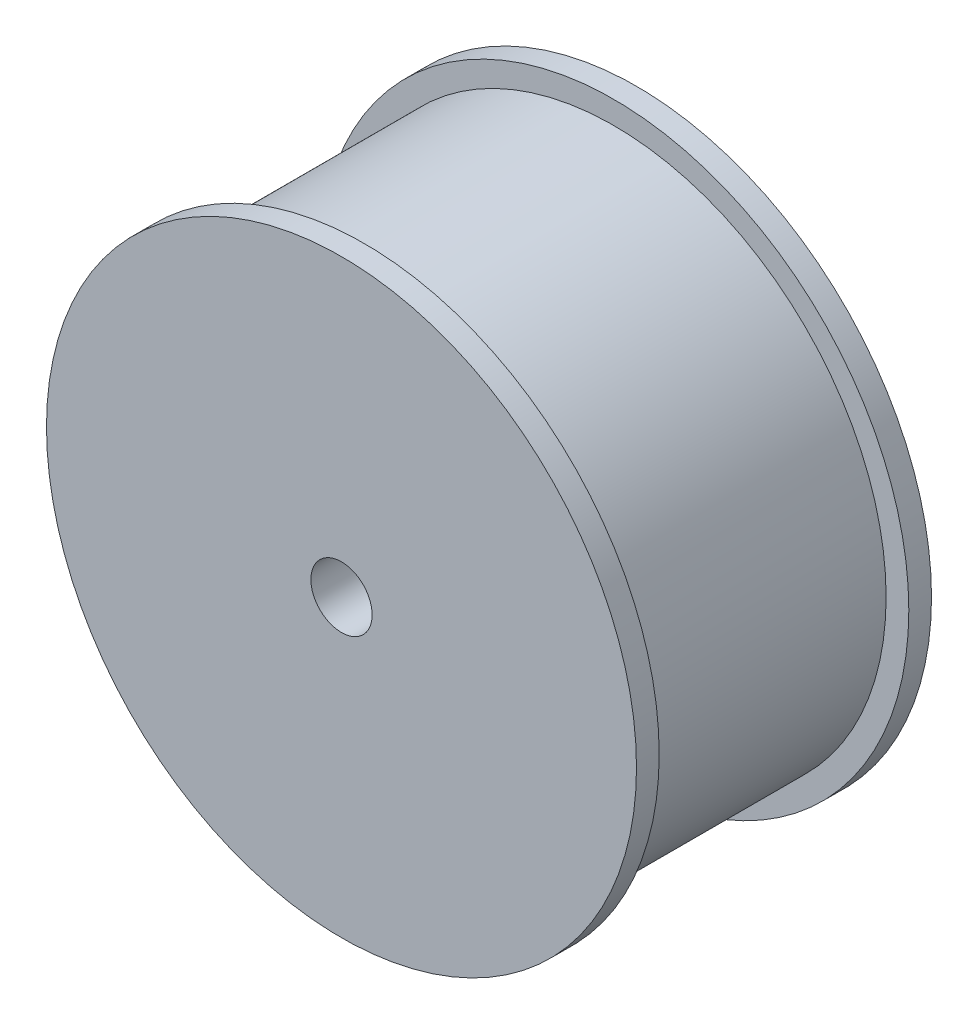
ISO-10303-21;
HEADER;
FILE_DESCRIPTION(('STEP AP214'),'2;1');
FILE_NAME('part.step','',(''),(''),'','','');
FILE_SCHEMA(('AUTOMOTIVE_DESIGN { 1 0 10303 214 1 1 1 1 }'));
ENDSEC;
DATA;
#1=APPLICATION_CONTEXT('core data for automotive mechanical design processes');
#2=APPLICATION_PROTOCOL_DEFINITION('international standard','automotive_design',2000,#1);
#3=PRODUCT_CONTEXT('',#1,'mechanical');
#4=PRODUCT('Part','Part','',(#3));
#5=PRODUCT_RELATED_PRODUCT_CATEGORY('part','',(#4));
#6=PRODUCT_DEFINITION_FORMATION('','',#4);
#7=PRODUCT_DEFINITION_CONTEXT('part definition',#1,'design');
#8=PRODUCT_DEFINITION('design','',#6,#7);
#9=PRODUCT_DEFINITION_SHAPE('','',#8);
#10=(LENGTH_UNIT() NAMED_UNIT(*) SI_UNIT(.MILLI.,.METRE.));
#11=(NAMED_UNIT(*) PLANE_ANGLE_UNIT() SI_UNIT($,.RADIAN.));
#12=(NAMED_UNIT(*) SI_UNIT($,.STERADIAN.) SOLID_ANGLE_UNIT());
#13=UNCERTAINTY_MEASURE_WITH_UNIT(LENGTH_MEASURE(1.E-05),#10,'distance_accuracy_value','');
#14=(GEOMETRIC_REPRESENTATION_CONTEXT(3) GLOBAL_UNCERTAINTY_ASSIGNED_CONTEXT((#13)) GLOBAL_UNIT_ASSIGNED_CONTEXT((#10,
#11,#12)) REPRESENTATION_CONTEXT('',''));
#15=CARTESIAN_POINT('',(0.,0.,0.));
#16=DIRECTION('',(0.,0.,1.));
#17=DIRECTION('',(1.,0.,0.));
#18=AXIS2_PLACEMENT_3D('',#15,#16,#17);
#19=CARTESIAN_POINT('',(0.,0.,-13.));
#20=DIRECTION('',(0.,0.,-1.));
#21=DIRECTION('',(1.,0.,0.));
#22=AXIS2_PLACEMENT_3D('',#19,#20,#21);
#23=PLANE('',#22);
#24=CARTESIAN_POINT('',(0.,0.,-13.));
#25=DIRECTION('',(0.,0.,1.));
#26=DIRECTION('',(1.,0.,0.));
#27=AXIS2_PLACEMENT_3D('',#24,#25,#26);
#28=CIRCLE('',#27,26.);
#29=CARTESIAN_POINT('',(26.,0.,-13.));
#30=VERTEX_POINT('',#29);
#31=EDGE_CURVE('E69',#30,#30,#28,.T.);
#32=ORIENTED_EDGE('',*,*,#31,.F.);
#33=EDGE_LOOP('',(#32));
#34=FACE_BOUND('',#33,.T.);
#35=CARTESIAN_POINT('',(0.,0.,-13.));
#36=DIRECTION('',(0.,0.,-1.));
#37=DIRECTION('',(-1.,0.,0.));
#38=AXIS2_PLACEMENT_3D('',#35,#36,#37);
#39=CIRCLE('',#38,6.5);
#40=CARTESIAN_POINT('',(-6.5,0.,-13.));
#41=VERTEX_POINT('',#40);
#42=EDGE_CURVE('E78',#41,#41,#39,.T.);
#43=ORIENTED_EDGE('',*,*,#42,.F.);
#44=EDGE_LOOP('',(#43));
#45=FACE_BOUND('',#44,.T.);
#46=ADVANCED_FACE('F45',(#34,#45),#23,.T.);
#47=CARTESIAN_POINT('',(0.,0.,11.));
#48=DIRECTION('',(0.,0.,-1.));
#49=DIRECTION('',(-1.,0.,0.));
#50=AXIS2_PLACEMENT_3D('',#47,#48,#49);
#51=CYLINDRICAL_SURFACE('',#50,24.);
#52=CARTESIAN_POINT('',(0.,0.,11.));
#53=DIRECTION('',(0.,0.,1.));
#54=DIRECTION('',(1.,0.,0.));
#55=AXIS2_PLACEMENT_3D('',#52,#53,#54);
#56=CIRCLE('',#55,24.);
#57=CARTESIAN_POINT('',(24.,0.,11.));
#58=VERTEX_POINT('',#57);
#59=EDGE_CURVE('E10',#58,#58,#56,.T.);
#60=ORIENTED_EDGE('',*,*,#59,.F.);
#61=EDGE_LOOP('',(#60));
#62=FACE_BOUND('',#61,.T.);
#63=CARTESIAN_POINT('',(0.,0.,-11.));
#64=DIRECTION('',(0.,0.,1.));
#65=DIRECTION('',(1.,0.,0.));
#66=AXIS2_PLACEMENT_3D('',#63,#64,#65);
#67=CIRCLE('',#66,24.);
#68=CARTESIAN_POINT('',(24.,0.,-11.));
#69=VERTEX_POINT('',#68);
#70=EDGE_CURVE('E49',#69,#69,#67,.T.);
#71=ORIENTED_EDGE('',*,*,#70,.T.);
#72=EDGE_LOOP('',(#71));
#73=FACE_BOUND('',#72,.T.);
#74=ADVANCED_FACE('F47',(#62,#73),#51,.T.);
#75=CARTESIAN_POINT('',(0.,0.,13.));
#76=DIRECTION('',(0.,0.,-1.));
#77=DIRECTION('',(-1.,0.,0.));
#78=AXIS2_PLACEMENT_3D('',#75,#76,#77);
#79=CYLINDRICAL_SURFACE('',#78,26.);
#80=CARTESIAN_POINT('',(0.,0.,13.));
#81=DIRECTION('',(0.,0.,1.));
#82=DIRECTION('',(1.,0.,0.));
#83=AXIS2_PLACEMENT_3D('',#80,#81,#82);
#84=CIRCLE('',#83,26.);
#85=CARTESIAN_POINT('',(26.,0.,13.));
#86=VERTEX_POINT('',#85);
#87=EDGE_CURVE('E54',#86,#86,#84,.T.);
#88=ORIENTED_EDGE('',*,*,#87,.F.);
#89=EDGE_LOOP('',(#88));
#90=FACE_BOUND('',#89,.T.);
#91=CARTESIAN_POINT('',(0.,0.,11.));
#92=DIRECTION('',(0.,0.,1.));
#93=DIRECTION('',(1.,0.,0.));
#94=AXIS2_PLACEMENT_3D('',#91,#92,#93);
#95=CIRCLE('',#94,26.);
#96=CARTESIAN_POINT('',(26.,0.,11.));
#97=VERTEX_POINT('',#96);
#98=EDGE_CURVE('E59',#97,#97,#95,.T.);
#99=ORIENTED_EDGE('',*,*,#98,.T.);
#100=EDGE_LOOP('',(#99));
#101=FACE_BOUND('',#100,.T.);
#102=ADVANCED_FACE('F112',(#90,#101),#79,.T.);
#103=CARTESIAN_POINT('',(0.,0.,13.));
#104=DIRECTION('',(0.,0.,1.));
#105=DIRECTION('',(1.,0.,0.));
#106=AXIS2_PLACEMENT_3D('',#103,#104,#105);
#107=PLANE('',#106);
#108=CARTESIAN_POINT('',(0.,0.,13.));
#109=DIRECTION('',(0.,0.,1.));
#110=DIRECTION('',(1.,0.,0.));
#111=AXIS2_PLACEMENT_3D('',#108,#109,#110);
#112=CIRCLE('',#111,2.7);
#113=CARTESIAN_POINT('',(2.7,0.,13.));
#114=VERTEX_POINT('',#113);
#115=EDGE_CURVE('E70',#114,#114,#112,.T.);
#116=ORIENTED_EDGE('',*,*,#115,.F.);
#117=EDGE_LOOP('',(#116));
#118=FACE_BOUND('',#117,.T.);
#119=ORIENTED_EDGE('',*,*,#87,.T.);
#120=EDGE_LOOP('',(#119));
#121=FACE_BOUND('',#120,.T.);
#122=ADVANCED_FACE('F125',(#118,#121),#107,.T.);
#123=CARTESIAN_POINT('',(0.,0.,11.));
#124=DIRECTION('',(0.,0.,1.));
#125=DIRECTION('',(1.,0.,0.));
#126=AXIS2_PLACEMENT_3D('',#123,#124,#125);
#127=PLANE('',#126);
#128=ORIENTED_EDGE('',*,*,#59,.T.);
#129=EDGE_LOOP('',(#128));
#130=FACE_BOUND('',#129,.T.);
#131=ORIENTED_EDGE('',*,*,#98,.F.);
#132=EDGE_LOOP('',(#131));
#133=FACE_BOUND('',#132,.T.);
#134=ADVANCED_FACE('F123',(#130,#133),#127,.F.);
#135=CARTESIAN_POINT('',(0.,0.,-13.));
#136=DIRECTION('',(0.,0.,1.));
#137=DIRECTION('',(1.,0.,0.));
#138=AXIS2_PLACEMENT_3D('',#135,#136,#137);
#139=CYLINDRICAL_SURFACE('',#138,26.);
#140=ORIENTED_EDGE('',*,*,#31,.T.);
#141=EDGE_LOOP('',(#140));
#142=FACE_BOUND('',#141,.T.);
#143=CARTESIAN_POINT('',(0.,0.,-11.));
#144=DIRECTION('',(0.,0.,1.));
#145=DIRECTION('',(1.,0.,0.));
#146=AXIS2_PLACEMENT_3D('',#143,#144,#145);
#147=CIRCLE('',#146,26.);
#148=CARTESIAN_POINT('',(26.,0.,-11.));
#149=VERTEX_POINT('',#148);
#150=EDGE_CURVE('E65',#149,#149,#147,.T.);
#151=ORIENTED_EDGE('',*,*,#150,.F.);
#152=EDGE_LOOP('',(#151));
#153=FACE_BOUND('',#152,.T.);
#154=ADVANCED_FACE('F119',(#142,#153),#139,.T.);
#155=CARTESIAN_POINT('',(0.,0.,-11.));
#156=DIRECTION('',(0.,0.,-1.));
#157=DIRECTION('',(1.,0.,0.));
#158=AXIS2_PLACEMENT_3D('',#155,#156,#157);
#159=PLANE('',#158);
#160=ORIENTED_EDGE('',*,*,#70,.F.);
#161=EDGE_LOOP('',(#160));
#162=FACE_BOUND('',#161,.T.);
#163=ORIENTED_EDGE('',*,*,#150,.T.);
#164=EDGE_LOOP('',(#163));
#165=FACE_BOUND('',#164,.T.);
#166=ADVANCED_FACE('F103',(#162,#165),#159,.F.);
#167=CARTESIAN_POINT('',(0.,0.,-13.));
#168=DIRECTION('',(0.,0.,1.));
#169=DIRECTION('',(1.,0.,0.));
#170=AXIS2_PLACEMENT_3D('',#167,#168,#169);
#171=CYLINDRICAL_SURFACE('',#170,2.7);
#172=CARTESIAN_POINT('',(0.,0.,-17.));
#173=DIRECTION('',(0.,0.,-1.));
#174=DIRECTION('',(-1.,0.,0.));
#175=AXIS2_PLACEMENT_3D('',#172,#173,#174);
#176=CIRCLE('',#175,2.7);
#177=CARTESIAN_POINT('',(2.7,0.,-17.));
#178=VERTEX_POINT('',#177);
#179=EDGE_CURVE('E82',#178,#178,#176,.T.);
#180=CARTESIAN_POINT('',(2.7,0.,13.));
#181=CARTESIAN_POINT('',(2.7,0.,12.6875));
#182=CARTESIAN_POINT('',(2.7,0.,12.375));
#183=CARTESIAN_POINT('',(2.7,0.,11.75));
#184=CARTESIAN_POINT('',(2.7,0.,11.4375));
#185=CARTESIAN_POINT('',(2.7,0.,10.8125));
#186=CARTESIAN_POINT('',(2.7,0.,10.5));
#187=CARTESIAN_POINT('',(2.7,0.,9.875));
#188=CARTESIAN_POINT('',(2.7,0.,9.5625));
#189=CARTESIAN_POINT('',(2.7,0.,8.9375));
#190=CARTESIAN_POINT('',(2.7,0.,8.625));
#191=CARTESIAN_POINT('',(2.7,0.,8.));
#192=CARTESIAN_POINT('',(2.7,0.,7.6875));
#193=CARTESIAN_POINT('',(2.7,0.,7.0625));
#194=CARTESIAN_POINT('',(2.7,0.,6.75));
#195=CARTESIAN_POINT('',(2.7,0.,6.125));
#196=CARTESIAN_POINT('',(2.7,0.,5.8125));
#197=CARTESIAN_POINT('',(2.7,0.,5.1875));
#198=CARTESIAN_POINT('',(2.7,0.,4.875));
#199=CARTESIAN_POINT('',(2.7,0.,4.25));
#200=CARTESIAN_POINT('',(2.7,0.,3.9375));
#201=CARTESIAN_POINT('',(2.7,0.,3.3125));
#202=CARTESIAN_POINT('',(2.7,0.,3.));
#203=CARTESIAN_POINT('',(2.7,0.,2.375));
#204=CARTESIAN_POINT('',(2.7,0.,2.0625));
#205=CARTESIAN_POINT('',(2.7,0.,1.4375));
#206=CARTESIAN_POINT('',(2.7,0.,1.125));
#207=CARTESIAN_POINT('',(2.7,0.,0.5));
#208=CARTESIAN_POINT('',(2.7,0.,0.1875));
#209=CARTESIAN_POINT('',(2.7,0.,-0.4375));
#210=CARTESIAN_POINT('',(2.7,0.,-0.75));
#211=CARTESIAN_POINT('',(2.7,0.,-1.375));
#212=CARTESIAN_POINT('',(2.7,0.,-1.6875));
#213=CARTESIAN_POINT('',(2.7,0.,-2.3125));
#214=CARTESIAN_POINT('',(2.7,0.,-2.625));
#215=CARTESIAN_POINT('',(2.7,0.,-3.25));
#216=CARTESIAN_POINT('',(2.7,0.,-3.5625));
#217=CARTESIAN_POINT('',(2.7,0.,-4.1875));
#218=CARTESIAN_POINT('',(2.7,0.,-4.5));
#219=CARTESIAN_POINT('',(2.7,0.,-5.125));
#220=CARTESIAN_POINT('',(2.7,0.,-5.4375));
#221=CARTESIAN_POINT('',(2.7,0.,-6.0625));
#222=CARTESIAN_POINT('',(2.7,0.,-6.375));
#223=CARTESIAN_POINT('',(2.7,0.,-7.));
#224=CARTESIAN_POINT('',(2.7,0.,-7.3125));
#225=CARTESIAN_POINT('',(2.7,0.,-7.9375));
#226=CARTESIAN_POINT('',(2.7,0.,-8.25));
#227=CARTESIAN_POINT('',(2.7,0.,-8.875));
#228=CARTESIAN_POINT('',(2.7,0.,-9.1875));
#229=CARTESIAN_POINT('',(2.7,0.,-9.8125));
#230=CARTESIAN_POINT('',(2.7,0.,-10.125));
#231=CARTESIAN_POINT('',(2.7,0.,-10.75));
#232=CARTESIAN_POINT('',(2.7,0.,-11.0625));
#233=CARTESIAN_POINT('',(2.7,0.,-11.6875));
#234=CARTESIAN_POINT('',(2.7,0.,-12.));
#235=CARTESIAN_POINT('',(2.7,0.,-12.625));
#236=CARTESIAN_POINT('',(2.7,0.,-12.9375));
#237=CARTESIAN_POINT('',(2.7,0.,-13.5625));
#238=CARTESIAN_POINT('',(2.7,0.,-13.875));
#239=CARTESIAN_POINT('',(2.7,0.,-14.5));
#240=CARTESIAN_POINT('',(2.7,0.,-14.8125));
#241=CARTESIAN_POINT('',(2.7,0.,-15.4375));
#242=CARTESIAN_POINT('',(2.7,0.,-15.75));
#243=CARTESIAN_POINT('',(2.7,0.,-16.375));
#244=CARTESIAN_POINT('',(2.7,0.,-16.6875));
#245=CARTESIAN_POINT('',(2.7,0.,-17.));
#246=B_SPLINE_CURVE_WITH_KNOTS('',3,(#180,#181,#182,#183,#184,#185,#186,#187,#188,#189,#190,
#191,#192,#193,#194,#195,#196,#197,#198,#199,#200,#201,#202,#203,#204,#205,#206,#207,#208,#209,
#210,#211,#212,#213,#214,#215,#216,#217,#218,#219,#220,#221,#222,#223,#224,#225,#226,#227,#228,
#229,#230,#231,#232,#233,#234,#235,#236,#237,#238,#239,#240,#241,#242,#243,#244,#245),
.UNSPECIFIED.,.F.,.F.,(4,2,2,2,2,2,2,2,2,2,2,2,2,2,2,2,2,2,2,2,2,2,2,2,2,2,2,2,2,2,2,2,4),(0.,
0.937500000000001,1.875,2.8125,3.75,4.6875,5.625,6.5625,7.5,8.4375,9.375,10.3125,11.25,12.1875,
13.125,14.0625,15.,15.9375,16.875,17.8125,18.75,19.6875,20.625,21.5625,22.5,23.4375,24.375,
25.3125,26.25,27.1875,28.125,29.0625,30.),.UNSPECIFIED.);
#247=EDGE_CURVE('BSEAM90',#114,#178,#246,.T.);
#248=ORIENTED_EDGE('',*,*,#115,.T.);
#249=ORIENTED_EDGE('',*,*,#179,.T.);
#250=ORIENTED_EDGE('',*,*,#247,.T.);
#251=ORIENTED_EDGE('',*,*,#247,.F.);
#252=EDGE_LOOP('',(#248,#250,#249,#251));
#253=FACE_BOUND('',#252,.T.);
#254=ADVANCED_FACE('F90',(#253),#171,.F.);
#255=CARTESIAN_POINT('',(0.,0.,-17.));
#256=DIRECTION('',(0.,0.,-1.));
#257=DIRECTION('',(-1.,0.,0.));
#258=AXIS2_PLACEMENT_3D('',#255,#256,#257);
#259=PLANE('',#258);
#260=CARTESIAN_POINT('',(0.,0.,-17.));
#261=DIRECTION('',(0.,0.,-1.));
#262=DIRECTION('',(-1.,0.,0.));
#263=AXIS2_PLACEMENT_3D('',#260,#261,#262);
#264=CIRCLE('',#263,6.5);
#265=CARTESIAN_POINT('',(-6.5,0.,-17.));
#266=VERTEX_POINT('',#265);
#267=EDGE_CURVE('E77',#266,#266,#264,.T.);
#268=ORIENTED_EDGE('',*,*,#267,.T.);
#269=EDGE_LOOP('',(#268));
#270=FACE_BOUND('',#269,.T.);
#271=ORIENTED_EDGE('',*,*,#179,.F.);
#272=EDGE_LOOP('',(#271));
#273=FACE_BOUND('',#272,.T.);
#274=ADVANCED_FACE('F92',(#270,#273),#259,.T.);
#275=CARTESIAN_POINT('',(0.,0.,-17.));
#276=DIRECTION('',(0.,0.,1.));
#277=DIRECTION('',(1.,0.,0.));
#278=AXIS2_PLACEMENT_3D('',#275,#276,#277);
#279=CYLINDRICAL_SURFACE('',#278,6.5);
#280=ORIENTED_EDGE('',*,*,#267,.F.);
#281=EDGE_LOOP('',(#280));
#282=FACE_BOUND('',#281,.T.);
#283=ORIENTED_EDGE('',*,*,#42,.T.);
#284=EDGE_LOOP('',(#283));
#285=FACE_BOUND('',#284,.T.);
#286=ADVANCED_FACE('F94',(#282,#285),#279,.T.);
#287=CLOSED_SHELL('',(#46,#74,#102,#122,#134,#154,#166,#254,#274,#286));
#288=MANIFOLD_SOLID_BREP('B2',#287);
#289=ADVANCED_BREP_SHAPE_REPRESENTATION('',(#18,#288),#14);
#290=SHAPE_DEFINITION_REPRESENTATION(#9,#289);
ENDSEC;
END-ISO-10303-21;
